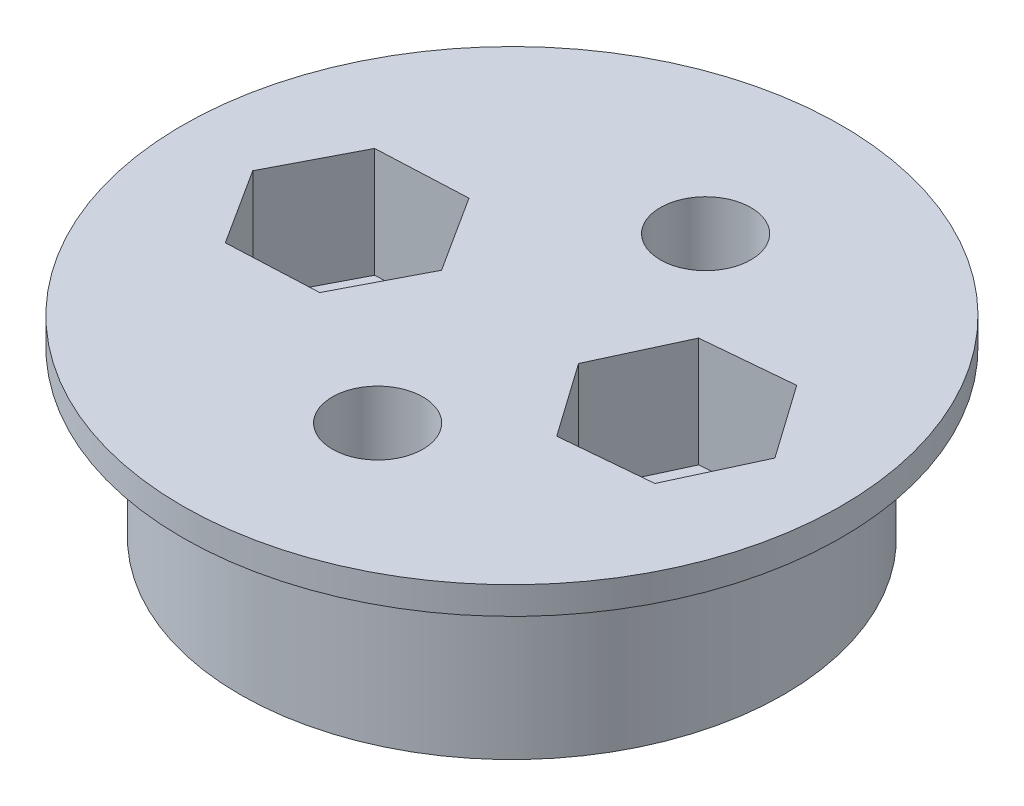
ISO-10303-21;
HEADER;
FILE_DESCRIPTION(('STEP AP214'),'2;1');
FILE_NAME('part.step','',(''),(''),'','','');
FILE_SCHEMA(('AUTOMOTIVE_DESIGN { 1 0 10303 214 1 1 1 1 }'));
ENDSEC;
DATA;
#1=APPLICATION_CONTEXT('core data for automotive mechanical design processes');
#2=APPLICATION_PROTOCOL_DEFINITION('international standard','automotive_design',2000,#1);
#3=PRODUCT_CONTEXT('',#1,'mechanical');
#4=PRODUCT('Part','Part','',(#3));
#5=PRODUCT_RELATED_PRODUCT_CATEGORY('part','',(#4));
#6=PRODUCT_DEFINITION_FORMATION('','',#4);
#7=PRODUCT_DEFINITION_CONTEXT('part definition',#1,'design');
#8=PRODUCT_DEFINITION('design','',#6,#7);
#9=PRODUCT_DEFINITION_SHAPE('','',#8);
#10=(LENGTH_UNIT() NAMED_UNIT(*) SI_UNIT(.MILLI.,.METRE.));
#11=(NAMED_UNIT(*) PLANE_ANGLE_UNIT() SI_UNIT($,.RADIAN.));
#12=(NAMED_UNIT(*) SI_UNIT($,.STERADIAN.) SOLID_ANGLE_UNIT());
#13=UNCERTAINTY_MEASURE_WITH_UNIT(LENGTH_MEASURE(1.E-05),#10,'distance_accuracy_value','');
#14=(GEOMETRIC_REPRESENTATION_CONTEXT(3) GLOBAL_UNCERTAINTY_ASSIGNED_CONTEXT((#13)) GLOBAL_UNIT_ASSIGNED_CONTEXT((#10,
#11,#12)) REPRESENTATION_CONTEXT('',''));
#15=CARTESIAN_POINT('',(0.,0.,0.));
#16=DIRECTION('',(0.,0.,1.));
#17=DIRECTION('',(1.,0.,0.));
#18=AXIS2_PLACEMENT_3D('',#15,#16,#17);
#19=CARTESIAN_POINT('',(4.12667433503604,-11.,-1.21099899694906));
#20=DIRECTION('',(0.,1.,0.));
#21=DIRECTION('',(0.,0.,1.));
#22=AXIS2_PLACEMENT_3D('',#19,#20,#21);
#23=CYLINDRICAL_SURFACE('',#22,1.65);
#24=CARTESIAN_POINT('',(4.12667433503604,-7.,-1.21099899694906));
#25=DIRECTION('',(0.,1.,0.));
#26=DIRECTION('',(0.,0.,1.));
#27=AXIS2_PLACEMENT_3D('',#24,#25,#26);
#28=CIRCLE('',#27,1.65);
#29=CARTESIAN_POINT('',(4.12667433503604,-7.,0.439001003050942));
#30=VERTEX_POINT('',#29);
#31=EDGE_CURVE('E239',#30,#30,#28,.T.);
#32=ORIENTED_EDGE('',*,*,#31,.F.);
#33=EDGE_LOOP('',(#32));
#34=FACE_BOUND('',#33,.T.);
#35=CARTESIAN_POINT('',(4.12667433503604,-4.,-1.21099899694906));
#36=DIRECTION('',(0.,1.,0.));
#37=DIRECTION('',(0.,0.,1.));
#38=AXIS2_PLACEMENT_3D('',#35,#36,#37);
#39=CIRCLE('',#38,1.65);
#40=CARTESIAN_POINT('',(4.12667433503604,-4.,0.439001003050942));
#41=VERTEX_POINT('',#40);
#42=EDGE_CURVE('E50',#41,#41,#39,.F.);
#43=ORIENTED_EDGE('',*,*,#42,.F.);
#44=EDGE_LOOP('',(#43));
#45=FACE_BOUND('',#44,.T.);
#46=ADVANCED_FACE('F43',(#34,#45),#23,.F.);
#47=CARTESIAN_POINT('',(-7.87332566496396,-11.,-1.21099899694906));
#48=DIRECTION('',(0.,1.,0.));
#49=DIRECTION('',(0.,0.,1.));
#50=AXIS2_PLACEMENT_3D('',#47,#48,#49);
#51=CYLINDRICAL_SURFACE('',#50,1.65);
#52=CARTESIAN_POINT('',(-7.87332566496396,-7.,-1.21099899694906));
#53=DIRECTION('',(0.,1.,0.));
#54=DIRECTION('',(0.,0.,1.));
#55=AXIS2_PLACEMENT_3D('',#52,#53,#54);
#56=CIRCLE('',#55,1.65);
#57=CARTESIAN_POINT('',(-7.87332566496396,-7.,0.439001003050943));
#58=VERTEX_POINT('',#57);
#59=EDGE_CURVE('E253',#58,#58,#56,.T.);
#60=ORIENTED_EDGE('',*,*,#59,.F.);
#61=EDGE_LOOP('',(#60));
#62=FACE_BOUND('',#61,.T.);
#63=CARTESIAN_POINT('',(-7.87332566496396,-4.,-1.21099899694906));
#64=DIRECTION('',(0.,1.,0.));
#65=DIRECTION('',(0.,0.,1.));
#66=AXIS2_PLACEMENT_3D('',#63,#64,#65);
#67=CIRCLE('',#66,1.65);
#68=CARTESIAN_POINT('',(-7.87332566496396,-4.,0.439001003050943));
#69=VERTEX_POINT('',#68);
#70=EDGE_CURVE('E185',#69,#69,#67,.F.);
#71=ORIENTED_EDGE('',*,*,#70,.F.);
#72=EDGE_LOOP('',(#71));
#73=FACE_BOUND('',#72,.T.);
#74=ADVANCED_FACE('F267',(#62,#73),#51,.F.);
#75=CARTESIAN_POINT('',(-1.87332566496396,-7.,-1.21099899694906));
#76=DIRECTION('',(0.,1.,0.));
#77=DIRECTION('',(0.,0.,1.));
#78=AXIS2_PLACEMENT_3D('',#75,#76,#77);
#79=CYLINDRICAL_SURFACE('',#78,9.9);
#80=CARTESIAN_POINT('',(-1.87332566496396,-7.,-1.21099899694906));
#81=DIRECTION('',(0.,1.,0.));
#82=DIRECTION('',(0.,0.,1.));
#83=AXIS2_PLACEMENT_3D('',#80,#81,#82);
#84=CIRCLE('',#83,9.9);
#85=CARTESIAN_POINT('',(-1.87332566496396,-7.,8.68900100305094));
#86=VERTEX_POINT('',#85);
#87=EDGE_CURVE('E11',#86,#86,#84,.T.);
#88=ORIENTED_EDGE('',*,*,#87,.T.);
#89=EDGE_LOOP('',(#88));
#90=FACE_BOUND('',#89,.T.);
#91=CARTESIAN_POINT('',(-1.87332566496396,-1.,-1.21099899694906));
#92=DIRECTION('',(0.,1.,0.));
#93=DIRECTION('',(0.,0.,1.));
#94=AXIS2_PLACEMENT_3D('',#91,#92,#93);
#95=CIRCLE('',#94,9.9);
#96=CARTESIAN_POINT('',(-1.87332566496396,-1.,8.68900100305094));
#97=VERTEX_POINT('',#96);
#98=EDGE_CURVE('E55',#97,#97,#95,.F.);
#99=ORIENTED_EDGE('',*,*,#98,.T.);
#100=EDGE_LOOP('',(#99));
#101=FACE_BOUND('',#100,.T.);
#102=ADVANCED_FACE('F44',(#90,#101),#79,.T.);
#103=CARTESIAN_POINT('',(-1.87332566496396,-7.,-1.21099899694906));
#104=DIRECTION('',(0.,1.,0.));
#105=DIRECTION('',(0.,0.,1.));
#106=AXIS2_PLACEMENT_3D('',#103,#104,#105);
#107=PLANE('',#106);
#108=ORIENTED_EDGE('',*,*,#59,.T.);
#109=EDGE_LOOP('',(#108));
#110=FACE_BOUND('',#109,.T.);
#111=CARTESIAN_POINT('',(-0.930431690280691,-7.,4.62155518404293));
#112=DIRECTION('',(0.,1.,0.));
#113=DIRECTION('',(0.,0.,1.));
#114=AXIS2_PLACEMENT_3D('',#111,#112,#113);
#115=CIRCLE('',#114,1.65);
#116=CARTESIAN_POINT('',(-0.930431690280691,-7.,6.27155518404293));
#117=VERTEX_POINT('',#116);
#118=EDGE_CURVE('E248',#117,#117,#115,.T.);
#119=ORIENTED_EDGE('',*,*,#118,.T.);
#120=EDGE_LOOP('',(#119));
#121=FACE_BOUND('',#120,.T.);
#122=CARTESIAN_POINT('',(-0.930431690280691,-7.,-7.32048650366668));
#123=DIRECTION('',(0.,1.,0.));
#124=DIRECTION('',(0.,0.,1.));
#125=AXIS2_PLACEMENT_3D('',#122,#123,#124);
#126=CIRCLE('',#125,1.65);
#127=CARTESIAN_POINT('',(-0.930431690280691,-7.,-5.67048650366668));
#128=VERTEX_POINT('',#127);
#129=EDGE_CURVE('E243',#128,#128,#126,.T.);
#130=ORIENTED_EDGE('',*,*,#129,.T.);
#131=EDGE_LOOP('',(#130));
#132=FACE_BOUND('',#131,.T.);
#133=ORIENTED_EDGE('',*,*,#31,.T.);
#134=EDGE_LOOP('',(#133));
#135=FACE_BOUND('',#134,.T.);
#136=ORIENTED_EDGE('',*,*,#87,.F.);
#137=EDGE_LOOP('',(#136));
#138=FACE_BOUND('',#137,.T.);
#139=ADVANCED_FACE('F292',(#110,#121,#132,#135,#138),#107,.F.);
#140=CARTESIAN_POINT('',(-1.87332566496396,-1.,-1.21099899694906));
#141=DIRECTION('',(0.,1.,0.));
#142=DIRECTION('',(0.,0.,1.));
#143=AXIS2_PLACEMENT_3D('',#140,#141,#142);
#144=CYLINDRICAL_SURFACE('',#143,12.);
#145=CARTESIAN_POINT('',(-1.87332566496396,-1.,-1.21099899694906));
#146=DIRECTION('',(0.,1.,0.));
#147=DIRECTION('',(0.,0.,1.));
#148=AXIS2_PLACEMENT_3D('',#145,#146,#147);
#149=CIRCLE('',#148,12.);
#150=CARTESIAN_POINT('',(-1.87332566496396,-1.,10.7890010030509));
#151=VERTEX_POINT('',#150);
#152=EDGE_CURVE('E254',#151,#151,#149,.T.);
#153=ORIENTED_EDGE('',*,*,#152,.T.);
#154=EDGE_LOOP('',(#153));
#155=FACE_BOUND('',#154,.T.);
#156=CARTESIAN_POINT('',(-1.87332566496396,0.,-1.21099899694906));
#157=DIRECTION('',(0.,1.,0.));
#158=DIRECTION('',(0.,0.,1.));
#159=AXIS2_PLACEMENT_3D('',#156,#157,#158);
#160=CIRCLE('',#159,12.);
#161=CARTESIAN_POINT('',(-1.87332566496396,0.,10.7890010030509));
#162=VERTEX_POINT('',#161);
#163=EDGE_CURVE('E255',#162,#162,#160,.T.);
#164=ORIENTED_EDGE('',*,*,#163,.F.);
#165=EDGE_LOOP('',(#164));
#166=FACE_BOUND('',#165,.T.);
#167=ADVANCED_FACE('F290',(#155,#166),#144,.T.);
#168=CARTESIAN_POINT('',(-1.87332566496396,-1.,-1.21099899694906));
#169=DIRECTION('',(0.,1.,0.));
#170=DIRECTION('',(0.,0.,1.));
#171=AXIS2_PLACEMENT_3D('',#168,#169,#170);
#172=PLANE('',#171);
#173=ORIENTED_EDGE('',*,*,#98,.F.);
#174=EDGE_LOOP('',(#173));
#175=FACE_BOUND('',#174,.T.);
#176=ORIENTED_EDGE('',*,*,#152,.F.);
#177=EDGE_LOOP('',(#176));
#178=FACE_BOUND('',#177,.T.);
#179=ADVANCED_FACE('F285',(#175,#178),#172,.F.);
#180=CARTESIAN_POINT('',(-1.87332566496396,0.,-1.21099899694906));
#181=DIRECTION('',(0.,1.,0.));
#182=DIRECTION('',(0.,0.,1.));
#183=AXIS2_PLACEMENT_3D('',#180,#181,#182);
#184=PLANE('',#183);
#185=DIRECTION('',(-0.538837070009728,0.,-0.842410002304894));
#186=VECTOR('',#185,1.);
#187=CARTESIAN_POINT('',(-4.58582863524953,0.,-1.36054256792031));
#188=LINE('',#187,#186);
#189=CARTESIAN_POINT('',(-4.58582863524953,0.,-1.36054256792031));
#190=VERTEX_POINT('',#189);
#191=CARTESIAN_POINT('',(-6.35908568154048,0.,-4.13282672503326));
#192=VERTEX_POINT('',#191);
#193=EDGE_CURVE('E58',#190,#192,#188,.T.);
#194=ORIENTED_EDGE('',*,*,#193,.F.);
#195=DIRECTION('',(0.460129927393282,0.,-0.887851592281645));
#196=VECTOR('',#195,1.);
#197=CARTESIAN_POINT('',(-6.100068618673,0.,1.5612851601639));
#198=LINE('',#197,#196);
#199=CARTESIAN_POINT('',(-6.100068618673,0.,1.5612851601639));
#200=VERTEX_POINT('',#199);
#201=EDGE_CURVE('E156',#200,#190,#198,.T.);
#202=ORIENTED_EDGE('',*,*,#201,.F.);
#203=DIRECTION('',(0.99896699740301,0.,-0.0454415899767515));
#204=VECTOR('',#203,1.);
#205=CARTESIAN_POINT('',(-9.38756564838743,0.,1.71082873113514));
#206=LINE('',#205,#204);
#207=CARTESIAN_POINT('',(-9.38756564838743,0.,1.71082873113514));
#208=VERTEX_POINT('',#207);
#209=EDGE_CURVE('E157',#208,#200,#206,.T.);
#210=ORIENTED_EDGE('',*,*,#209,.F.);
#211=DIRECTION('',(0.538837070009728,0.,0.842410002304894));
#212=VECTOR('',#211,1.);
#213=CARTESIAN_POINT('',(-11.1608226946784,0.,-1.06145542597781));
#214=LINE('',#213,#212);
#215=CARTESIAN_POINT('',(-11.1608226946784,0.,-1.06145542597781));
#216=VERTEX_POINT('',#215);
#217=EDGE_CURVE('E173',#216,#208,#214,.T.);
#218=ORIENTED_EDGE('',*,*,#217,.F.);
#219=DIRECTION('',(-0.460129927393282,0.,0.887851592281645));
#220=VECTOR('',#219,1.);
#221=CARTESIAN_POINT('',(-9.64658271125491,0.,-3.98328315406201));
#222=LINE('',#221,#220);
#223=CARTESIAN_POINT('',(-9.64658271125491,0.,-3.98328315406201));
#224=VERTEX_POINT('',#223);
#225=EDGE_CURVE('E174',#224,#216,#222,.T.);
#226=ORIENTED_EDGE('',*,*,#225,.F.);
#227=DIRECTION('',(-0.99896699740301,0.,0.0454415899767515));
#228=VECTOR('',#227,1.);
#229=CARTESIAN_POINT('',(-6.35908568154048,0.,-4.13282672503326));
#230=LINE('',#229,#228);
#231=EDGE_CURVE('E168',#192,#224,#230,.T.);
#232=ORIENTED_EDGE('',*,*,#231,.F.);
#233=EDGE_LOOP('',(#194,#202,#210,#218,#226,#232));
#234=FACE_BOUND('',#233,.T.);
#235=DIRECTION('',(-0.995945989770633,0.,0.0899532404074193));
#236=VECTOR('',#235,1.);
#237=CARTESIAN_POINT('',(5.50908520295825,0.,-4.19745847135191));
#238=LINE('',#237,#236);
#239=CARTESIAN_POINT('',(5.50908520295825,0.,-4.19745847135191));
#240=VERTEX_POINT('',#239);
#241=CARTESIAN_POINT('',(2.23152999679155,0.,-3.90143166423881));
#242=VERTEX_POINT('',#241);
#243=EDGE_CURVE('E68',#240,#242,#238,.T.);
#244=ORIENTED_EDGE('',*,*,#243,.F.);
#245=DIRECTION('',(-0.57587478623087,0.,-0.817537907734895));
#246=VECTOR('',#245,1.);
#247=CARTESIAN_POINT('',(7.40422954120274,0.,-1.50702580406216));
#248=LINE('',#247,#246);
#249=CARTESIAN_POINT('',(7.40422954120274,0.,-1.50702580406216));
#250=VERTEX_POINT('',#249);
#251=EDGE_CURVE('E201',#250,#240,#248,.T.);
#252=ORIENTED_EDGE('',*,*,#251,.F.);
#253=DIRECTION('',(0.420071203539762,0.,-0.907491148142314));
#254=VECTOR('',#253,1.);
#255=CARTESIAN_POINT('',(6.02181867328054,0.,1.47943367034069));
#256=LINE('',#255,#254);
#257=CARTESIAN_POINT('',(6.02181867328054,0.,1.47943367034069));
#258=VERTEX_POINT('',#257);
#259=EDGE_CURVE('E206',#258,#250,#256,.T.);
#260=ORIENTED_EDGE('',*,*,#259,.F.);
#261=DIRECTION('',(0.995945989770633,0.,-0.0899532404074193));
#262=VECTOR('',#261,1.);
#263=CARTESIAN_POINT('',(2.74426346711384,0.,1.7754604774538));
#264=LINE('',#263,#262);
#265=CARTESIAN_POINT('',(2.74426346711384,0.,1.7754604774538));
#266=VERTEX_POINT('',#265);
#267=EDGE_CURVE('E209',#266,#258,#264,.T.);
#268=ORIENTED_EDGE('',*,*,#267,.F.);
#269=DIRECTION('',(0.57587478623087,0.,0.817537907734895));
#270=VECTOR('',#269,1.);
#271=CARTESIAN_POINT('',(0.849119128869347,0.,-0.914972189835952));
#272=LINE('',#271,#270);
#273=CARTESIAN_POINT('',(0.849119128869347,0.,-0.914972189835952));
#274=VERTEX_POINT('',#273);
#275=EDGE_CURVE('E213',#274,#266,#272,.T.);
#276=ORIENTED_EDGE('',*,*,#275,.F.);
#277=DIRECTION('',(-0.420071203539763,0.,0.907491148142314));
#278=VECTOR('',#277,1.);
#279=CARTESIAN_POINT('',(2.23152999679155,0.,-3.90143166423881));
#280=LINE('',#279,#278);
#281=EDGE_CURVE('E216',#242,#274,#280,.T.);
#282=ORIENTED_EDGE('',*,*,#281,.F.);
#283=EDGE_LOOP('',(#244,#252,#260,#268,#276,#282));
#284=FACE_BOUND('',#283,.T.);
#285=CARTESIAN_POINT('',(-0.930431690280691,0.,4.62155518404293));
#286=DIRECTION('',(0.,1.,0.));
#287=DIRECTION('',(0.,0.,1.));
#288=AXIS2_PLACEMENT_3D('',#285,#286,#287);
#289=CIRCLE('',#288,1.65);
#290=CARTESIAN_POINT('',(-0.930431690280691,0.,6.27155518404293));
#291=VERTEX_POINT('',#290);
#292=EDGE_CURVE('E237',#291,#291,#289,.T.);
#293=ORIENTED_EDGE('',*,*,#292,.F.);
#294=EDGE_LOOP('',(#293));
#295=FACE_BOUND('',#294,.T.);
#296=CARTESIAN_POINT('',(-0.930431690280691,0.,-7.32048650366668));
#297=DIRECTION('',(0.,1.,0.));
#298=DIRECTION('',(0.,0.,1.));
#299=AXIS2_PLACEMENT_3D('',#296,#297,#298);
#300=CIRCLE('',#299,1.65);
#301=CARTESIAN_POINT('',(-0.930431690280691,0.,-5.67048650366668));
#302=VERTEX_POINT('',#301);
#303=EDGE_CURVE('E238',#302,#302,#300,.T.);
#304=ORIENTED_EDGE('',*,*,#303,.F.);
#305=EDGE_LOOP('',(#304));
#306=FACE_BOUND('',#305,.T.);
#307=ORIENTED_EDGE('',*,*,#163,.T.);
#308=EDGE_LOOP('',(#307));
#309=FACE_BOUND('',#308,.T.);
#310=ADVANCED_FACE('F287',(#234,#284,#295,#306,#309),#184,.T.);
#311=CARTESIAN_POINT('',(-0.930431690280691,-11.,-7.32048650366668));
#312=DIRECTION('',(0.,1.,0.));
#313=DIRECTION('',(0.,0.,1.));
#314=AXIS2_PLACEMENT_3D('',#311,#312,#313);
#315=CYLINDRICAL_SURFACE('',#314,1.65);
#316=ORIENTED_EDGE('',*,*,#303,.T.);
#317=EDGE_LOOP('',(#316));
#318=FACE_BOUND('',#317,.T.);
#319=ORIENTED_EDGE('',*,*,#129,.F.);
#320=EDGE_LOOP('',(#319));
#321=FACE_BOUND('',#320,.T.);
#322=ADVANCED_FACE('F282',(#318,#321),#315,.F.);
#323=CARTESIAN_POINT('',(-0.930431690280691,-11.,4.62155518404293));
#324=DIRECTION('',(0.,1.,0.));
#325=DIRECTION('',(0.,0.,1.));
#326=AXIS2_PLACEMENT_3D('',#323,#324,#325);
#327=CYLINDRICAL_SURFACE('',#326,1.65);
#328=ORIENTED_EDGE('',*,*,#292,.T.);
#329=EDGE_LOOP('',(#328));
#330=FACE_BOUND('',#329,.T.);
#331=ORIENTED_EDGE('',*,*,#118,.F.);
#332=EDGE_LOOP('',(#331));
#333=FACE_BOUND('',#332,.T.);
#334=ADVANCED_FACE('F302',(#330,#333),#327,.F.);
#335=CARTESIAN_POINT('',(0.,-4.,0.));
#336=DIRECTION('',(0.,1.,0.));
#337=DIRECTION('',(0.,0.,1.));
#338=AXIS2_PLACEMENT_3D('',#335,#336,#337);
#339=PLANE('',#338);
#340=DIRECTION('',(-0.538837070009728,0.,-0.842410002304894));
#341=VECTOR('',#340,1.);
#342=CARTESIAN_POINT('',(-4.58582863524953,-4.,-1.36054256792031));
#343=LINE('',#342,#341);
#344=CARTESIAN_POINT('',(-4.58582863524953,-4.,-1.36054256792031));
#345=VERTEX_POINT('',#344);
#346=CARTESIAN_POINT('',(-6.35908568154048,-4.,-4.13282672503326));
#347=VERTEX_POINT('',#346);
#348=EDGE_CURVE('E137',#345,#347,#343,.T.);
#349=ORIENTED_EDGE('',*,*,#348,.T.);
#350=DIRECTION('',(-0.99896699740301,0.,0.0454415899767515));
#351=VECTOR('',#350,1.);
#352=CARTESIAN_POINT('',(-6.35908568154048,-4.,-4.13282672503326));
#353=LINE('',#352,#351);
#354=CARTESIAN_POINT('',(-9.64658271125491,-4.,-3.98328315406201));
#355=VERTEX_POINT('',#354);
#356=EDGE_CURVE('E144',#347,#355,#353,.T.);
#357=ORIENTED_EDGE('',*,*,#356,.T.);
#358=DIRECTION('',(-0.460129927393282,0.,0.887851592281645));
#359=VECTOR('',#358,1.);
#360=CARTESIAN_POINT('',(-9.64658271125491,-4.,-3.98328315406201));
#361=LINE('',#360,#359);
#362=CARTESIAN_POINT('',(-11.1608226946784,-4.,-1.06145542597781));
#363=VERTEX_POINT('',#362);
#364=EDGE_CURVE('E147',#355,#363,#361,.T.);
#365=ORIENTED_EDGE('',*,*,#364,.T.);
#366=DIRECTION('',(0.538837070009728,0.,0.842410002304894));
#367=VECTOR('',#366,1.);
#368=CARTESIAN_POINT('',(-11.1608226946784,-4.,-1.06145542597781));
#369=LINE('',#368,#367);
#370=CARTESIAN_POINT('',(-9.38756564838743,-4.,1.71082873113514));
#371=VERTEX_POINT('',#370);
#372=EDGE_CURVE('E162',#363,#371,#369,.T.);
#373=ORIENTED_EDGE('',*,*,#372,.T.);
#374=DIRECTION('',(0.99896699740301,0.,-0.0454415899767515));
#375=VECTOR('',#374,1.);
#376=CARTESIAN_POINT('',(-9.38756564838743,-4.,1.71082873113514));
#377=LINE('',#376,#375);
#378=CARTESIAN_POINT('',(-6.100068618673,-4.,1.5612851601639));
#379=VERTEX_POINT('',#378);
#380=EDGE_CURVE('E167',#371,#379,#377,.T.);
#381=ORIENTED_EDGE('',*,*,#380,.T.);
#382=DIRECTION('',(0.460129927393282,0.,-0.887851592281645));
#383=VECTOR('',#382,1.);
#384=CARTESIAN_POINT('',(-6.100068618673,-4.,1.5612851601639));
#385=LINE('',#384,#383);
#386=EDGE_CURVE('E142',#379,#345,#385,.T.);
#387=ORIENTED_EDGE('',*,*,#386,.T.);
#388=EDGE_LOOP('',(#349,#357,#365,#373,#381,#387));
#389=FACE_BOUND('',#388,.T.);
#390=ORIENTED_EDGE('',*,*,#70,.T.);
#391=EDGE_LOOP('',(#390));
#392=FACE_BOUND('',#391,.T.);
#393=ADVANCED_FACE('F155',(#389,#392),#339,.T.);
#394=CARTESIAN_POINT('',(-4.58582863524953,-4.,-1.36054256792031));
#395=DIRECTION('',(0.842410002304894,0.,-0.538837070009728));
#396=DIRECTION('',(-0.538837070009728,0.,-0.842410002304894));
#397=AXIS2_PLACEMENT_3D('',#394,#395,#396);
#398=PLANE('',#397);
#399=ORIENTED_EDGE('',*,*,#193,.T.);
#400=DIRECTION('',(0.,1.,0.));
#401=VECTOR('',#400,1.);
#402=CARTESIAN_POINT('',(-6.35908568154048,-4.,-4.13282672503326));
#403=LINE('',#402,#401);
#404=EDGE_CURVE('E134',#347,#192,#403,.T.);
#405=ORIENTED_EDGE('',*,*,#404,.F.);
#406=ORIENTED_EDGE('',*,*,#348,.F.);
#407=DIRECTION('',(0.,1.,0.));
#408=VECTOR('',#407,1.);
#409=CARTESIAN_POINT('',(-4.58582863524953,-4.,-1.36054256792031));
#410=LINE('',#409,#408);
#411=EDGE_CURVE('E176',#345,#190,#410,.T.);
#412=ORIENTED_EDGE('',*,*,#411,.T.);
#413=EDGE_LOOP('',(#399,#405,#406,#412));
#414=FACE_BOUND('',#413,.T.);
#415=ADVANCED_FACE('F131',(#414),#398,.F.);
#416=CARTESIAN_POINT('',(-6.100068618673,-4.,1.5612851601639));
#417=DIRECTION('',(0.887851592281645,0.,0.460129927393282));
#418=DIRECTION('',(0.460129927393282,0.,-0.887851592281645));
#419=AXIS2_PLACEMENT_3D('',#416,#417,#418);
#420=PLANE('',#419);
#421=ORIENTED_EDGE('',*,*,#201,.T.);
#422=ORIENTED_EDGE('',*,*,#411,.F.);
#423=ORIENTED_EDGE('',*,*,#386,.F.);
#424=DIRECTION('',(0.,1.,0.));
#425=VECTOR('',#424,1.);
#426=CARTESIAN_POINT('',(-6.100068618673,-4.,1.5612851601639));
#427=LINE('',#426,#425);
#428=EDGE_CURVE('E181',#379,#200,#427,.T.);
#429=ORIENTED_EDGE('',*,*,#428,.T.);
#430=EDGE_LOOP('',(#421,#422,#423,#429));
#431=FACE_BOUND('',#430,.T.);
#432=ADVANCED_FACE('F356',(#431),#420,.F.);
#433=CARTESIAN_POINT('',(-9.38756564838743,-4.,1.71082873113514));
#434=DIRECTION('',(0.0454415899767515,0.,0.99896699740301));
#435=DIRECTION('',(0.99896699740301,0.,-0.0454415899767515));
#436=AXIS2_PLACEMENT_3D('',#433,#434,#435);
#437=PLANE('',#436);
#438=ORIENTED_EDGE('',*,*,#209,.T.);
#439=ORIENTED_EDGE('',*,*,#428,.F.);
#440=ORIENTED_EDGE('',*,*,#380,.F.);
#441=DIRECTION('',(0.,1.,0.));
#442=VECTOR('',#441,1.);
#443=CARTESIAN_POINT('',(-9.38756564838743,-4.,1.71082873113514));
#444=LINE('',#443,#442);
#445=EDGE_CURVE('E183',#371,#208,#444,.T.);
#446=ORIENTED_EDGE('',*,*,#445,.T.);
#447=EDGE_LOOP('',(#438,#439,#440,#446));
#448=FACE_BOUND('',#447,.T.);
#449=ADVANCED_FACE('F369',(#448),#437,.F.);
#450=CARTESIAN_POINT('',(-11.1608226946784,-4.,-1.06145542597781));
#451=DIRECTION('',(-0.842410002304894,0.,0.538837070009728));
#452=DIRECTION('',(0.538837070009728,0.,0.842410002304894));
#453=AXIS2_PLACEMENT_3D('',#450,#451,#452);
#454=PLANE('',#453);
#455=ORIENTED_EDGE('',*,*,#217,.T.);
#456=ORIENTED_EDGE('',*,*,#445,.F.);
#457=ORIENTED_EDGE('',*,*,#372,.F.);
#458=DIRECTION('',(0.,1.,0.));
#459=VECTOR('',#458,1.);
#460=CARTESIAN_POINT('',(-11.1608226946784,-4.,-1.06145542597781));
#461=LINE('',#460,#459);
#462=EDGE_CURVE('E189',#363,#216,#461,.T.);
#463=ORIENTED_EDGE('',*,*,#462,.T.);
#464=EDGE_LOOP('',(#455,#456,#457,#463));
#465=FACE_BOUND('',#464,.T.);
#466=ADVANCED_FACE('F377',(#465),#454,.F.);
#467=CARTESIAN_POINT('',(-9.64658271125491,-4.,-3.98328315406201));
#468=DIRECTION('',(-0.887851592281645,0.,-0.460129927393282));
#469=DIRECTION('',(-0.460129927393282,0.,0.887851592281645));
#470=AXIS2_PLACEMENT_3D('',#467,#468,#469);
#471=PLANE('',#470);
#472=ORIENTED_EDGE('',*,*,#225,.T.);
#473=ORIENTED_EDGE('',*,*,#462,.F.);
#474=ORIENTED_EDGE('',*,*,#364,.F.);
#475=DIRECTION('',(0.,1.,0.));
#476=VECTOR('',#475,1.);
#477=CARTESIAN_POINT('',(-9.64658271125491,-4.,-3.98328315406201));
#478=LINE('',#477,#476);
#479=EDGE_CURVE('E143',#355,#224,#478,.T.);
#480=ORIENTED_EDGE('',*,*,#479,.T.);
#481=EDGE_LOOP('',(#472,#473,#474,#480));
#482=FACE_BOUND('',#481,.T.);
#483=ADVANCED_FACE('F386',(#482),#471,.F.);
#484=CARTESIAN_POINT('',(-6.35908568154048,-4.,-4.13282672503326));
#485=DIRECTION('',(-0.0454415899767515,0.,-0.99896699740301));
#486=DIRECTION('',(-0.99896699740301,0.,0.0454415899767515));
#487=AXIS2_PLACEMENT_3D('',#484,#485,#486);
#488=PLANE('',#487);
#489=ORIENTED_EDGE('',*,*,#231,.T.);
#490=ORIENTED_EDGE('',*,*,#479,.F.);
#491=ORIENTED_EDGE('',*,*,#356,.F.);
#492=ORIENTED_EDGE('',*,*,#404,.T.);
#493=EDGE_LOOP('',(#489,#490,#491,#492));
#494=FACE_BOUND('',#493,.T.);
#495=ADVANCED_FACE('F148',(#494),#488,.F.);
#496=CARTESIAN_POINT('',(0.,-4.,0.));
#497=DIRECTION('',(0.,1.,0.));
#498=DIRECTION('',(0.,0.,1.));
#499=AXIS2_PLACEMENT_3D('',#496,#497,#498);
#500=PLANE('',#499);
#501=DIRECTION('',(-0.995945989770633,0.,0.0899532404074193));
#502=VECTOR('',#501,1.);
#503=CARTESIAN_POINT('',(5.50908520295825,-4.,-4.19745847135191));
#504=LINE('',#503,#502);
#505=CARTESIAN_POINT('',(5.50908520295825,-4.,-4.19745847135191));
#506=VERTEX_POINT('',#505);
#507=CARTESIAN_POINT('',(2.23152999679155,-4.,-3.90143166423881));
#508=VERTEX_POINT('',#507);
#509=EDGE_CURVE('E210',#506,#508,#504,.T.);
#510=ORIENTED_EDGE('',*,*,#509,.T.);
#511=DIRECTION('',(-0.420071203539763,0.,0.907491148142314));
#512=VECTOR('',#511,1.);
#513=CARTESIAN_POINT('',(2.23152999679155,-4.,-3.90143166423881));
#514=LINE('',#513,#512);
#515=CARTESIAN_POINT('',(0.849119128869347,-4.,-0.914972189835952));
#516=VERTEX_POINT('',#515);
#517=EDGE_CURVE('E232',#508,#516,#514,.T.);
#518=ORIENTED_EDGE('',*,*,#517,.T.);
#519=DIRECTION('',(0.57587478623087,0.,0.817537907734895));
#520=VECTOR('',#519,1.);
#521=CARTESIAN_POINT('',(0.849119128869347,-4.,-0.914972189835952));
#522=LINE('',#521,#520);
#523=CARTESIAN_POINT('',(2.74426346711384,-4.,1.7754604774538));
#524=VERTEX_POINT('',#523);
#525=EDGE_CURVE('E230',#516,#524,#522,.T.);
#526=ORIENTED_EDGE('',*,*,#525,.T.);
#527=DIRECTION('',(0.995945989770633,0.,-0.0899532404074193));
#528=VECTOR('',#527,1.);
#529=CARTESIAN_POINT('',(2.74426346711384,-4.,1.7754604774538));
#530=LINE('',#529,#528);
#531=CARTESIAN_POINT('',(6.02181867328054,-4.,1.47943367034069));
#532=VERTEX_POINT('',#531);
#533=EDGE_CURVE('E223',#524,#532,#530,.T.);
#534=ORIENTED_EDGE('',*,*,#533,.T.);
#535=DIRECTION('',(0.420071203539762,0.,-0.907491148142314));
#536=VECTOR('',#535,1.);
#537=CARTESIAN_POINT('',(6.02181867328054,-4.,1.47943367034069));
#538=LINE('',#537,#536);
#539=CARTESIAN_POINT('',(7.40422954120274,-4.,-1.50702580406216));
#540=VERTEX_POINT('',#539);
#541=EDGE_CURVE('E225',#532,#540,#538,.T.);
#542=ORIENTED_EDGE('',*,*,#541,.T.);
#543=DIRECTION('',(-0.57587478623087,0.,-0.817537907734895));
#544=VECTOR('',#543,1.);
#545=CARTESIAN_POINT('',(7.40422954120274,-4.,-1.50702580406216));
#546=LINE('',#545,#544);
#547=EDGE_CURVE('E195',#540,#506,#546,.T.);
#548=ORIENTED_EDGE('',*,*,#547,.T.);
#549=EDGE_LOOP('',(#510,#518,#526,#534,#542,#548));
#550=FACE_BOUND('',#549,.T.);
#551=ORIENTED_EDGE('',*,*,#42,.T.);
#552=EDGE_LOOP('',(#551));
#553=FACE_BOUND('',#552,.T.);
#554=ADVANCED_FACE('F266',(#550,#553),#500,.T.);
#555=CARTESIAN_POINT('',(5.50908520295825,-4.,-4.19745847135191));
#556=DIRECTION('',(-0.0899532404074193,0.,-0.995945989770633));
#557=DIRECTION('',(-0.995945989770633,0.,0.0899532404074193));
#558=AXIS2_PLACEMENT_3D('',#555,#556,#557);
#559=PLANE('',#558);
#560=ORIENTED_EDGE('',*,*,#243,.T.);
#561=DIRECTION('',(0.,1.,0.));
#562=VECTOR('',#561,1.);
#563=CARTESIAN_POINT('',(2.23152999679155,-4.,-3.90143166423881));
#564=LINE('',#563,#562);
#565=EDGE_CURVE('E188',#508,#242,#564,.T.);
#566=ORIENTED_EDGE('',*,*,#565,.F.);
#567=ORIENTED_EDGE('',*,*,#509,.F.);
#568=DIRECTION('',(0.,1.,0.));
#569=VECTOR('',#568,1.);
#570=CARTESIAN_POINT('',(5.50908520295825,-4.,-4.19745847135191));
#571=LINE('',#570,#569);
#572=EDGE_CURVE('E203',#506,#240,#571,.T.);
#573=ORIENTED_EDGE('',*,*,#572,.T.);
#574=EDGE_LOOP('',(#560,#566,#567,#573));
#575=FACE_BOUND('',#574,.T.);
#576=ADVANCED_FACE('F418',(#575),#559,.F.);
#577=CARTESIAN_POINT('',(7.40422954120274,-4.,-1.50702580406216));
#578=DIRECTION('',(0.817537907734895,0.,-0.57587478623087));
#579=DIRECTION('',(-0.57587478623087,0.,-0.817537907734895));
#580=AXIS2_PLACEMENT_3D('',#577,#578,#579);
#581=PLANE('',#580);
#582=ORIENTED_EDGE('',*,*,#251,.T.);
#583=ORIENTED_EDGE('',*,*,#572,.F.);
#584=ORIENTED_EDGE('',*,*,#547,.F.);
#585=DIRECTION('',(0.,1.,0.));
#586=VECTOR('',#585,1.);
#587=CARTESIAN_POINT('',(7.40422954120274,-4.,-1.50702580406216));
#588=LINE('',#587,#586);
#589=EDGE_CURVE('E200',#540,#250,#588,.T.);
#590=ORIENTED_EDGE('',*,*,#589,.T.);
#591=EDGE_LOOP('',(#582,#583,#584,#590));
#592=FACE_BOUND('',#591,.T.);
#593=ADVANCED_FACE('F426',(#592),#581,.F.);
#594=CARTESIAN_POINT('',(6.02181867328054,-4.,1.47943367034069));
#595=DIRECTION('',(0.907491148142314,0.,0.420071203539762));
#596=DIRECTION('',(0.420071203539762,0.,-0.907491148142314));
#597=AXIS2_PLACEMENT_3D('',#594,#595,#596);
#598=PLANE('',#597);
#599=ORIENTED_EDGE('',*,*,#259,.T.);
#600=ORIENTED_EDGE('',*,*,#589,.F.);
#601=ORIENTED_EDGE('',*,*,#541,.F.);
#602=DIRECTION('',(0.,1.,0.));
#603=VECTOR('',#602,1.);
#604=CARTESIAN_POINT('',(6.02181867328054,-4.,1.47943367034069));
#605=LINE('',#604,#603);
#606=EDGE_CURVE('E197',#532,#258,#605,.T.);
#607=ORIENTED_EDGE('',*,*,#606,.T.);
#608=EDGE_LOOP('',(#599,#600,#601,#607));
#609=FACE_BOUND('',#608,.T.);
#610=ADVANCED_FACE('F434',(#609),#598,.F.);
#611=CARTESIAN_POINT('',(2.74426346711384,-4.,1.7754604774538));
#612=DIRECTION('',(0.0899532404074193,0.,0.995945989770633));
#613=DIRECTION('',(0.995945989770633,0.,-0.0899532404074193));
#614=AXIS2_PLACEMENT_3D('',#611,#612,#613);
#615=PLANE('',#614);
#616=ORIENTED_EDGE('',*,*,#267,.T.);
#617=ORIENTED_EDGE('',*,*,#606,.F.);
#618=ORIENTED_EDGE('',*,*,#533,.F.);
#619=DIRECTION('',(0.,1.,0.));
#620=VECTOR('',#619,1.);
#621=CARTESIAN_POINT('',(2.74426346711384,-4.,1.7754604774538));
#622=LINE('',#621,#620);
#623=EDGE_CURVE('E191',#524,#266,#622,.T.);
#624=ORIENTED_EDGE('',*,*,#623,.T.);
#625=EDGE_LOOP('',(#616,#617,#618,#624));
#626=FACE_BOUND('',#625,.T.);
#627=ADVANCED_FACE('F443',(#626),#615,.F.);
#628=CARTESIAN_POINT('',(0.849119128869347,-4.,-0.914972189835952));
#629=DIRECTION('',(-0.817537907734895,0.,0.57587478623087));
#630=DIRECTION('',(0.57587478623087,0.,0.817537907734895));
#631=AXIS2_PLACEMENT_3D('',#628,#629,#630);
#632=PLANE('',#631);
#633=ORIENTED_EDGE('',*,*,#275,.T.);
#634=ORIENTED_EDGE('',*,*,#623,.F.);
#635=ORIENTED_EDGE('',*,*,#525,.F.);
#636=DIRECTION('',(0.,1.,0.));
#637=VECTOR('',#636,1.);
#638=CARTESIAN_POINT('',(0.849119128869347,-4.,-0.914972189835952));
#639=LINE('',#638,#637);
#640=EDGE_CURVE('E193',#516,#274,#639,.T.);
#641=ORIENTED_EDGE('',*,*,#640,.T.);
#642=EDGE_LOOP('',(#633,#634,#635,#641));
#643=FACE_BOUND('',#642,.T.);
#644=ADVANCED_FACE('F451',(#643),#632,.F.);
#645=CARTESIAN_POINT('',(2.23152999679155,-4.,-3.90143166423881));
#646=DIRECTION('',(-0.907491148142314,0.,-0.420071203539762));
#647=DIRECTION('',(-0.420071203539763,0.,0.907491148142314));
#648=AXIS2_PLACEMENT_3D('',#645,#646,#647);
#649=PLANE('',#648);
#650=ORIENTED_EDGE('',*,*,#281,.T.);
#651=ORIENTED_EDGE('',*,*,#640,.F.);
#652=ORIENTED_EDGE('',*,*,#517,.F.);
#653=ORIENTED_EDGE('',*,*,#565,.T.);
#654=EDGE_LOOP('',(#650,#651,#652,#653));
#655=FACE_BOUND('',#654,.T.);
#656=ADVANCED_FACE('F463',(#655),#649,.F.);
#657=CLOSED_SHELL('',(#46,#74,#102,#139,#167,#179,#310,#322,#334,#393,#415,#432,#449,#466,#483,
#495,#554,#576,#593,#610,#627,#644,#656));
#658=MANIFOLD_SOLID_BREP('B2',#657);
#659=ADVANCED_BREP_SHAPE_REPRESENTATION('',(#18,#658),#14);
#660=SHAPE_DEFINITION_REPRESENTATION(#9,#659);
ENDSEC;
END-ISO-10303-21;
